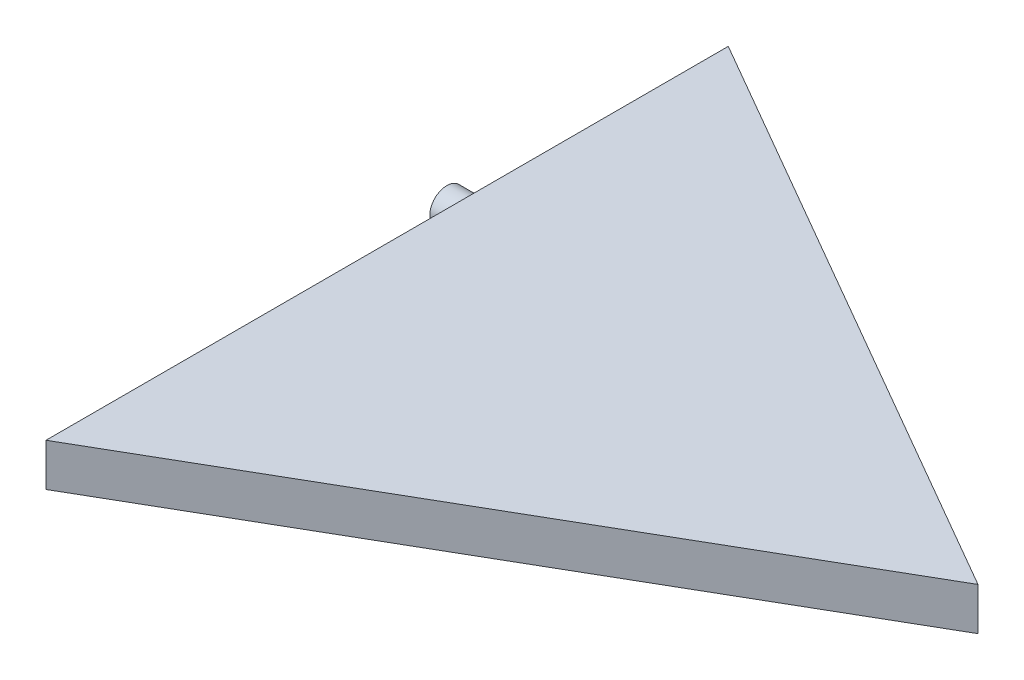
ISO-10303-21;
HEADER;
FILE_DESCRIPTION(('STEP AP214'),'2;1');
FILE_NAME('part.step','',(''),(''),'','','');
FILE_SCHEMA(('AUTOMOTIVE_DESIGN { 1 0 10303 214 1 1 1 1 }'));
ENDSEC;
DATA;
#1=APPLICATION_CONTEXT('core data for automotive mechanical design processes');
#2=APPLICATION_PROTOCOL_DEFINITION('international standard','automotive_design',2000,#1);
#3=PRODUCT_CONTEXT('',#1,'mechanical');
#4=PRODUCT('Part','Part','',(#3));
#5=PRODUCT_RELATED_PRODUCT_CATEGORY('part','',(#4));
#6=PRODUCT_DEFINITION_FORMATION('','',#4);
#7=PRODUCT_DEFINITION_CONTEXT('part definition',#1,'design');
#8=PRODUCT_DEFINITION('design','',#6,#7);
#9=PRODUCT_DEFINITION_SHAPE('','',#8);
#10=(LENGTH_UNIT() NAMED_UNIT(*) SI_UNIT(.MILLI.,.METRE.));
#11=(NAMED_UNIT(*) PLANE_ANGLE_UNIT() SI_UNIT($,.RADIAN.));
#12=(NAMED_UNIT(*) SI_UNIT($,.STERADIAN.) SOLID_ANGLE_UNIT());
#13=UNCERTAINTY_MEASURE_WITH_UNIT(LENGTH_MEASURE(1.E-05),#10,'distance_accuracy_value','');
#14=(GEOMETRIC_REPRESENTATION_CONTEXT(3) GLOBAL_UNCERTAINTY_ASSIGNED_CONTEXT((#13)) GLOBAL_UNIT_ASSIGNED_CONTEXT((#10,
#11,#12)) REPRESENTATION_CONTEXT('',''));
#15=CARTESIAN_POINT('',(0.,0.,0.));
#16=DIRECTION('',(0.,0.,1.));
#17=DIRECTION('',(1.,0.,0.));
#18=AXIS2_PLACEMENT_3D('',#15,#16,#17);
#19=CARTESIAN_POINT('',(-69.2820323027551,5.,40.));
#20=DIRECTION('',(-0.5,0.,-0.866025403784439));
#21=DIRECTION('',(-0.866025403784439,0.,0.5));
#22=AXIS2_PLACEMENT_3D('',#19,#20,#21);
#23=PLANE('',#22);
#24=DIRECTION('',(0.866025403784439,0.,-0.5));
#25=VECTOR('',#24,1.);
#26=CARTESIAN_POINT('',(-69.2820323027551,0.,40.));
#27=LINE('',#26,#25);
#28=CARTESIAN_POINT('',(-69.2820323027551,0.,40.));
#29=VERTEX_POINT('',#28);
#30=CARTESIAN_POINT('',(0.,0.,0.));
#31=VERTEX_POINT('',#30);
#32=EDGE_CURVE('E90',#29,#31,#27,.T.);
#33=ORIENTED_EDGE('',*,*,#32,.T.);
#34=DIRECTION('',(0.,-1.,0.));
#35=VECTOR('',#34,1.);
#36=CARTESIAN_POINT('',(0.,5.,0.));
#37=LINE('',#36,#35);
#38=CARTESIAN_POINT('',(0.,5.,0.));
#39=VERTEX_POINT('',#38);
#40=EDGE_CURVE('E47',#39,#31,#37,.T.);
#41=ORIENTED_EDGE('',*,*,#40,.F.);
#42=DIRECTION('',(0.866025403784439,0.,-0.5));
#43=VECTOR('',#42,1.);
#44=CARTESIAN_POINT('',(-69.2820323027551,5.,40.));
#45=LINE('',#44,#43);
#46=CARTESIAN_POINT('',(-69.2820323027551,5.,40.));
#47=VERTEX_POINT('',#46);
#48=EDGE_CURVE('E82',#47,#39,#45,.T.);
#49=ORIENTED_EDGE('',*,*,#48,.F.);
#50=DIRECTION('',(0.,-1.,0.));
#51=VECTOR('',#50,1.);
#52=CARTESIAN_POINT('',(-69.2820323027551,5.,40.));
#53=LINE('',#52,#51);
#54=EDGE_CURVE('E93',#47,#29,#53,.T.);
#55=ORIENTED_EDGE('',*,*,#54,.T.);
#56=EDGE_LOOP('',(#33,#41,#49,#55));
#57=FACE_BOUND('',#56,.T.);
#58=ADVANCED_FACE('F38',(#57),#23,.F.);
#59=CARTESIAN_POINT('',(-69.2820323027551,5.,-40.));
#60=DIRECTION('',(-0.5,0.,0.866025403784439));
#61=DIRECTION('',(0.866025403784439,0.,0.5));
#62=AXIS2_PLACEMENT_3D('',#59,#60,#61);
#63=PLANE('',#62);
#64=DIRECTION('',(-0.866025403784439,0.,-0.5));
#65=VECTOR('',#64,1.);
#66=CARTESIAN_POINT('',(-69.2820323027551,0.,-40.));
#67=LINE('',#66,#65);
#68=CARTESIAN_POINT('',(-69.2820323027551,0.,-40.));
#69=VERTEX_POINT('',#68);
#70=EDGE_CURVE('E68',#31,#69,#67,.T.);
#71=ORIENTED_EDGE('',*,*,#70,.T.);
#72=DIRECTION('',(0.,-1.,0.));
#73=VECTOR('',#72,1.);
#74=CARTESIAN_POINT('',(-69.2820323027551,5.,-40.));
#75=LINE('',#74,#73);
#76=CARTESIAN_POINT('',(-69.2820323027551,5.,-40.));
#77=VERTEX_POINT('',#76);
#78=EDGE_CURVE('E80',#77,#69,#75,.T.);
#79=ORIENTED_EDGE('',*,*,#78,.F.);
#80=DIRECTION('',(-0.866025403784439,0.,-0.5));
#81=VECTOR('',#80,1.);
#82=CARTESIAN_POINT('',(-69.2820323027551,5.,-40.));
#83=LINE('',#82,#81);
#84=EDGE_CURVE('E76',#39,#77,#83,.T.);
#85=ORIENTED_EDGE('',*,*,#84,.F.);
#86=ORIENTED_EDGE('',*,*,#40,.T.);
#87=EDGE_LOOP('',(#71,#79,#85,#86));
#88=FACE_BOUND('',#87,.T.);
#89=ADVANCED_FACE('F77',(#88),#63,.F.);
#90=CARTESIAN_POINT('',(-69.2820323027551,5.,40.));
#91=DIRECTION('',(1.,0.,0.));
#92=DIRECTION('',(0.,0.,-1.));
#93=AXIS2_PLACEMENT_3D('',#90,#91,#92);
#94=PLANE('',#93);
#95=CARTESIAN_POINT('',(-69.2820323027551,2.36016021409569,-10.));
#96=DIRECTION('',(1.,0.,0.));
#97=DIRECTION('',(0.,0.,-1.));
#98=AXIS2_PLACEMENT_3D('',#95,#96,#97);
#99=CIRCLE('',#98,2.);
#100=CARTESIAN_POINT('',(-69.2820323027551,2.36016021409569,-12.));
#101=VERTEX_POINT('',#100);
#102=EDGE_CURVE('E11',#101,#101,#99,.F.);
#103=ORIENTED_EDGE('',*,*,#102,.F.);
#104=EDGE_LOOP('',(#103));
#105=FACE_BOUND('',#104,.T.);
#106=DIRECTION('',(0.,0.,1.));
#107=VECTOR('',#106,1.);
#108=CARTESIAN_POINT('',(-69.2820323027551,0.,40.));
#109=LINE('',#108,#107);
#110=EDGE_CURVE('E73',#69,#29,#109,.T.);
#111=ORIENTED_EDGE('',*,*,#110,.T.);
#112=ORIENTED_EDGE('',*,*,#54,.F.);
#113=DIRECTION('',(0.,0.,1.));
#114=VECTOR('',#113,1.);
#115=CARTESIAN_POINT('',(-69.2820323027551,5.,40.));
#116=LINE('',#115,#114);
#117=EDGE_CURVE('E55',#77,#47,#116,.T.);
#118=ORIENTED_EDGE('',*,*,#117,.F.);
#119=ORIENTED_EDGE('',*,*,#78,.T.);
#120=EDGE_LOOP('',(#111,#112,#118,#119));
#121=FACE_BOUND('',#120,.T.);
#122=ADVANCED_FACE('F120',(#105,#121),#94,.F.);
#123=CARTESIAN_POINT('',(0.,5.,0.));
#124=DIRECTION('',(0.,-1.,0.));
#125=DIRECTION('',(0.,0.,-1.));
#126=AXIS2_PLACEMENT_3D('',#123,#124,#125);
#127=PLANE('',#126);
#128=ORIENTED_EDGE('',*,*,#48,.T.);
#129=ORIENTED_EDGE('',*,*,#84,.T.);
#130=ORIENTED_EDGE('',*,*,#117,.T.);
#131=EDGE_LOOP('',(#128,#129,#130));
#132=FACE_BOUND('',#131,.T.);
#133=ADVANCED_FACE('F85',(#132),#127,.F.);
#134=CARTESIAN_POINT('',(0.,0.,0.));
#135=DIRECTION('',(0.,-1.,0.));
#136=DIRECTION('',(0.,0.,-1.));
#137=AXIS2_PLACEMENT_3D('',#134,#135,#136);
#138=PLANE('',#137);
#139=ORIENTED_EDGE('',*,*,#32,.F.);
#140=ORIENTED_EDGE('',*,*,#110,.F.);
#141=ORIENTED_EDGE('',*,*,#70,.F.);
#142=EDGE_LOOP('',(#139,#140,#141));
#143=FACE_BOUND('',#142,.T.);
#144=ADVANCED_FACE('F116',(#143),#138,.T.);
#145=CARTESIAN_POINT('',(-72.2820323027551,2.36016021409569,-10.));
#146=DIRECTION('',(1.,0.,0.));
#147=DIRECTION('',(0.,0.,-1.));
#148=AXIS2_PLACEMENT_3D('',#145,#146,#147);
#149=CYLINDRICAL_SURFACE('',#148,2.);
#150=CARTESIAN_POINT('',(-72.2820323027551,2.36016021409569,-10.));
#151=DIRECTION('',(-1.,0.,0.));
#152=DIRECTION('',(0.,0.,1.));
#153=AXIS2_PLACEMENT_3D('',#150,#151,#152);
#154=CIRCLE('',#153,2.);
#155=CARTESIAN_POINT('',(-72.2820323027551,2.36016021409569,-8.));
#156=VERTEX_POINT('',#155);
#157=EDGE_CURVE('E104',#156,#156,#154,.T.);
#158=ORIENTED_EDGE('',*,*,#157,.F.);
#159=EDGE_LOOP('',(#158));
#160=FACE_BOUND('',#159,.T.);
#161=ORIENTED_EDGE('',*,*,#102,.T.);
#162=EDGE_LOOP('',(#161));
#163=FACE_BOUND('',#162,.T.);
#164=ADVANCED_FACE('F113',(#160,#163),#149,.T.);
#165=CARTESIAN_POINT('',(-72.2820323027551,2.36016021409569,-10.));
#166=DIRECTION('',(-1.,0.,0.));
#167=DIRECTION('',(0.,0.,1.));
#168=AXIS2_PLACEMENT_3D('',#165,#166,#167);
#169=PLANE('',#168);
#170=ORIENTED_EDGE('',*,*,#157,.T.);
#171=EDGE_LOOP('',(#170));
#172=FACE_BOUND('',#171,.T.);
#173=ADVANCED_FACE('F111',(#172),#169,.T.);
#174=CLOSED_SHELL('',(#58,#89,#122,#133,#144,#164,#173));
#175=MANIFOLD_SOLID_BREP('B2',#174);
#176=ADVANCED_BREP_SHAPE_REPRESENTATION('',(#18,#175),#14);
#177=SHAPE_DEFINITION_REPRESENTATION(#9,#176);
ENDSEC;
END-ISO-10303-21;
